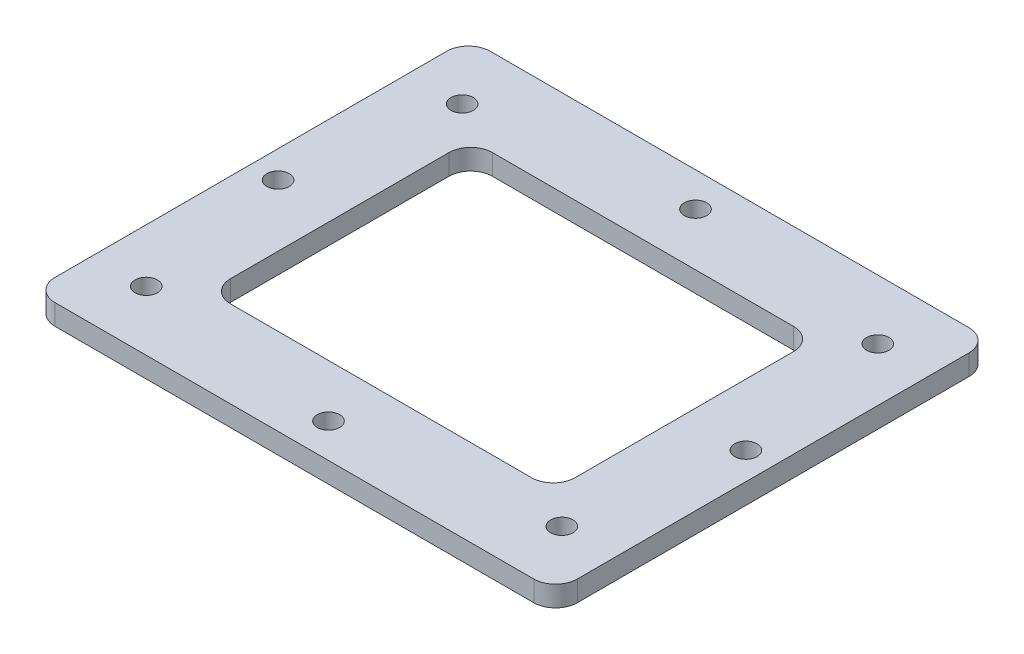
ISO-10303-21;
HEADER;
FILE_DESCRIPTION(('STEP AP214'),'2;1');
FILE_NAME('part.step','',(''),(''),'','','');
FILE_SCHEMA(('AUTOMOTIVE_DESIGN { 1 0 10303 214 1 1 1 1 }'));
ENDSEC;
DATA;
#1=APPLICATION_CONTEXT('core data for automotive mechanical design processes');
#2=APPLICATION_PROTOCOL_DEFINITION('international standard','automotive_design',2000,#1);
#3=PRODUCT_CONTEXT('',#1,'mechanical');
#4=PRODUCT('Part','Part','',(#3));
#5=PRODUCT_RELATED_PRODUCT_CATEGORY('part','',(#4));
#6=PRODUCT_DEFINITION_FORMATION('','',#4);
#7=PRODUCT_DEFINITION_CONTEXT('part definition',#1,'design');
#8=PRODUCT_DEFINITION('design','',#6,#7);
#9=PRODUCT_DEFINITION_SHAPE('','',#8);
#10=(LENGTH_UNIT() NAMED_UNIT(*) SI_UNIT(.MILLI.,.METRE.));
#11=(NAMED_UNIT(*) PLANE_ANGLE_UNIT() SI_UNIT($,.RADIAN.));
#12=(NAMED_UNIT(*) SI_UNIT($,.STERADIAN.) SOLID_ANGLE_UNIT());
#13=UNCERTAINTY_MEASURE_WITH_UNIT(LENGTH_MEASURE(1.E-05),#10,'distance_accuracy_value','');
#14=(GEOMETRIC_REPRESENTATION_CONTEXT(3) GLOBAL_UNCERTAINTY_ASSIGNED_CONTEXT((#13)) GLOBAL_UNIT_ASSIGNED_CONTEXT((#10,
#11,#12)) REPRESENTATION_CONTEXT('',''));
#15=CARTESIAN_POINT('',(0.,0.,0.));
#16=DIRECTION('',(0.,0.,1.));
#17=DIRECTION('',(1.,0.,0.));
#18=AXIS2_PLACEMENT_3D('',#15,#16,#17);
#19=CARTESIAN_POINT('',(0.,1.5,0.));
#20=DIRECTION('',(0.,1.,0.));
#21=DIRECTION('',(0.,0.,1.));
#22=AXIS2_PLACEMENT_3D('',#19,#20,#21);
#23=PLANE('',#22);
#24=CARTESIAN_POINT('',(-34.125,1.5,0.));
#25=DIRECTION('',(0.,1.,0.));
#26=DIRECTION('',(0.,0.,1.));
#27=AXIS2_PLACEMENT_3D('',#24,#25,#26);
#28=CIRCLE('',#27,1.63195);
#29=CARTESIAN_POINT('',(-34.125,1.5,1.63195000000001));
#30=VERTEX_POINT('',#29);
#31=EDGE_CURVE('E335',#30,#30,#28,.T.);
#32=ORIENTED_EDGE('',*,*,#31,.F.);
#33=EDGE_LOOP('',(#32));
#34=FACE_BOUND('',#33,.T.);
#35=CARTESIAN_POINT('',(-30.315,1.5,23.045));
#36=DIRECTION('',(0.,1.,0.));
#37=DIRECTION('',(0.,0.,1.));
#38=AXIS2_PLACEMENT_3D('',#35,#36,#37);
#39=CIRCLE('',#38,1.63195);
#40=CARTESIAN_POINT('',(-30.315,1.5,24.67695));
#41=VERTEX_POINT('',#40);
#42=EDGE_CURVE('E322',#41,#41,#39,.T.);
#43=ORIENTED_EDGE('',*,*,#42,.F.);
#44=EDGE_LOOP('',(#43));
#45=FACE_BOUND('',#44,.T.);
#46=CARTESIAN_POINT('',(0.,1.5,26.77));
#47=DIRECTION('',(0.,1.,0.));
#48=DIRECTION('',(0.,0.,1.));
#49=AXIS2_PLACEMENT_3D('',#46,#47,#48);
#50=CIRCLE('',#49,1.63195);
#51=CARTESIAN_POINT('',(0.,1.5,28.40195));
#52=VERTEX_POINT('',#51);
#53=EDGE_CURVE('E318',#52,#52,#50,.T.);
#54=ORIENTED_EDGE('',*,*,#53,.F.);
#55=EDGE_LOOP('',(#54));
#56=FACE_BOUND('',#55,.T.);
#57=CARTESIAN_POINT('',(30.315,1.5,23.045));
#58=DIRECTION('',(0.,1.,0.));
#59=DIRECTION('',(0.,0.,1.));
#60=AXIS2_PLACEMENT_3D('',#57,#58,#59);
#61=CIRCLE('',#60,1.63195);
#62=CARTESIAN_POINT('',(30.315,1.5,24.67695));
#63=VERTEX_POINT('',#62);
#64=EDGE_CURVE('E314',#63,#63,#61,.T.);
#65=ORIENTED_EDGE('',*,*,#64,.F.);
#66=EDGE_LOOP('',(#65));
#67=FACE_BOUND('',#66,.T.);
#68=CARTESIAN_POINT('',(34.125,1.5,0.));
#69=DIRECTION('',(0.,1.,0.));
#70=DIRECTION('',(0.,0.,1.));
#71=AXIS2_PLACEMENT_3D('',#68,#69,#70);
#72=CIRCLE('',#71,1.63195);
#73=CARTESIAN_POINT('',(34.125,1.5,1.63195000000001));
#74=VERTEX_POINT('',#73);
#75=EDGE_CURVE('E309',#74,#74,#72,.T.);
#76=ORIENTED_EDGE('',*,*,#75,.F.);
#77=EDGE_LOOP('',(#76));
#78=FACE_BOUND('',#77,.T.);
#79=CARTESIAN_POINT('',(30.315,1.5,-23.045));
#80=DIRECTION('',(0.,1.,0.));
#81=DIRECTION('',(0.,0.,1.));
#82=AXIS2_PLACEMENT_3D('',#79,#80,#81);
#83=CIRCLE('',#82,1.63195);
#84=CARTESIAN_POINT('',(30.315,1.5,-21.41305));
#85=VERTEX_POINT('',#84);
#86=EDGE_CURVE('E304',#85,#85,#83,.T.);
#87=ORIENTED_EDGE('',*,*,#86,.F.);
#88=EDGE_LOOP('',(#87));
#89=FACE_BOUND('',#88,.T.);
#90=CARTESIAN_POINT('',(0.,1.5,-26.77));
#91=DIRECTION('',(0.,1.,0.));
#92=DIRECTION('',(0.,0.,1.));
#93=AXIS2_PLACEMENT_3D('',#90,#91,#92);
#94=CIRCLE('',#93,1.63195);
#95=CARTESIAN_POINT('',(0.,1.5,-25.13805));
#96=VERTEX_POINT('',#95);
#97=EDGE_CURVE('E299',#96,#96,#94,.T.);
#98=ORIENTED_EDGE('',*,*,#97,.F.);
#99=EDGE_LOOP('',(#98));
#100=FACE_BOUND('',#99,.T.);
#101=CARTESIAN_POINT('',(-30.315,1.5,-23.045));
#102=DIRECTION('',(0.,1.,0.));
#103=DIRECTION('',(0.,0.,1.));
#104=AXIS2_PLACEMENT_3D('',#101,#102,#103);
#105=CIRCLE('',#104,1.63195);
#106=CARTESIAN_POINT('',(-30.315,1.5,-21.41305));
#107=VERTEX_POINT('',#106);
#108=EDGE_CURVE('E294',#107,#107,#105,.T.);
#109=ORIENTED_EDGE('',*,*,#108,.F.);
#110=EDGE_LOOP('',(#109));
#111=FACE_BOUND('',#110,.T.);
#112=DIRECTION('',(-1.,0.,0.));
#113=VECTOR('',#112,1.);
#114=CARTESIAN_POINT('',(-38.1,1.5,-31.75));
#115=LINE('',#114,#113);
#116=CARTESIAN_POINT('',(34.925,1.5,-31.75));
#117=VERTEX_POINT('',#116);
#118=CARTESIAN_POINT('',(-34.925,1.5,-31.75));
#119=VERTEX_POINT('',#118);
#120=EDGE_CURVE('E380',#117,#119,#115,.T.);
#121=ORIENTED_EDGE('',*,*,#120,.T.);
#122=CARTESIAN_POINT('',(-34.925,1.5,-28.575));
#123=DIRECTION('',(0.,1.,0.));
#124=DIRECTION('',(0.,0.,1.));
#125=AXIS2_PLACEMENT_3D('',#122,#123,#124);
#126=CIRCLE('',#125,3.175);
#127=CARTESIAN_POINT('',(-38.1,1.5,-28.575));
#128=VERTEX_POINT('',#127);
#129=EDGE_CURVE('E256',#119,#128,#126,.T.);
#130=ORIENTED_EDGE('',*,*,#129,.T.);
#131=DIRECTION('',(0.,0.,1.));
#132=VECTOR('',#131,1.);
#133=CARTESIAN_POINT('',(-38.1,1.5,-31.75));
#134=LINE('',#133,#132);
#135=CARTESIAN_POINT('',(-38.1,1.5,28.575));
#136=VERTEX_POINT('',#135);
#137=EDGE_CURVE('E197',#128,#136,#134,.T.);
#138=ORIENTED_EDGE('',*,*,#137,.T.);
#139=CARTESIAN_POINT('',(-34.925,1.5,28.575));
#140=DIRECTION('',(0.,1.,0.));
#141=DIRECTION('',(0.,0.,1.));
#142=AXIS2_PLACEMENT_3D('',#139,#140,#141);
#143=CIRCLE('',#142,3.175);
#144=CARTESIAN_POINT('',(-34.925,1.5,31.75));
#145=VERTEX_POINT('',#144);
#146=EDGE_CURVE('E72',#136,#145,#143,.T.);
#147=ORIENTED_EDGE('',*,*,#146,.T.);
#148=DIRECTION('',(1.,0.,0.));
#149=VECTOR('',#148,1.);
#150=CARTESIAN_POINT('',(-38.1,1.5,31.75));
#151=LINE('',#150,#149);
#152=CARTESIAN_POINT('',(34.925,1.5,31.75));
#153=VERTEX_POINT('',#152);
#154=EDGE_CURVE('E191',#145,#153,#151,.T.);
#155=ORIENTED_EDGE('',*,*,#154,.T.);
#156=CARTESIAN_POINT('',(34.925,1.5,28.575));
#157=DIRECTION('',(0.,1.,0.));
#158=DIRECTION('',(0.,0.,1.));
#159=AXIS2_PLACEMENT_3D('',#156,#157,#158);
#160=CIRCLE('',#159,3.175);
#161=CARTESIAN_POINT('',(38.1,1.5,28.575));
#162=VERTEX_POINT('',#161);
#163=EDGE_CURVE('E250',#153,#162,#160,.T.);
#164=ORIENTED_EDGE('',*,*,#163,.T.);
#165=DIRECTION('',(0.,0.,-1.));
#166=VECTOR('',#165,1.);
#167=CARTESIAN_POINT('',(38.1,1.5,-31.75));
#168=LINE('',#167,#166);
#169=CARTESIAN_POINT('',(38.1,1.5,-28.575));
#170=VERTEX_POINT('',#169);
#171=EDGE_CURVE('E376',#162,#170,#168,.T.);
#172=ORIENTED_EDGE('',*,*,#171,.T.);
#173=CARTESIAN_POINT('',(34.925,1.5,-28.575));
#174=DIRECTION('',(0.,1.,0.));
#175=DIRECTION('',(0.,0.,1.));
#176=AXIS2_PLACEMENT_3D('',#173,#174,#175);
#177=CIRCLE('',#176,3.175);
#178=EDGE_CURVE('E253',#170,#117,#177,.T.);
#179=ORIENTED_EDGE('',*,*,#178,.T.);
#180=EDGE_LOOP('',(#121,#130,#138,#147,#155,#164,#172,#179));
#181=FACE_BOUND('',#180,.T.);
#182=DIRECTION('',(-1.,0.,0.));
#183=VECTOR('',#182,1.);
#184=CARTESIAN_POINT('',(-25.140406267068,1.5,-19.1113528756254));
#185=LINE('',#184,#183);
#186=CARTESIAN_POINT('',(21.965406267068,1.5,-19.1113528756254));
#187=VERTEX_POINT('',#186);
#188=CARTESIAN_POINT('',(-21.965406267068,1.5,-19.1113528756254));
#189=VERTEX_POINT('',#188);
#190=EDGE_CURVE('E357',#187,#189,#185,.T.);
#191=ORIENTED_EDGE('',*,*,#190,.F.);
#192=CARTESIAN_POINT('',(21.965406267068,1.5,-15.9363528756254));
#193=DIRECTION('',(0.,1.,0.));
#194=DIRECTION('',(0.,0.,1.));
#195=AXIS2_PLACEMENT_3D('',#192,#193,#194);
#196=CIRCLE('',#195,3.175);
#197=CARTESIAN_POINT('',(25.140406267068,1.5,-15.9363528756254));
#198=VERTEX_POINT('',#197);
#199=EDGE_CURVE('E175',#187,#198,#196,.F.);
#200=ORIENTED_EDGE('',*,*,#199,.T.);
#201=DIRECTION('',(0.,0.,-1.));
#202=VECTOR('',#201,1.);
#203=CARTESIAN_POINT('',(25.140406267068,1.5,-19.1113528756254));
#204=LINE('',#203,#202);
#205=CARTESIAN_POINT('',(25.140406267068,1.5,15.9363528756254));
#206=VERTEX_POINT('',#205);
#207=EDGE_CURVE('E353',#206,#198,#204,.T.);
#208=ORIENTED_EDGE('',*,*,#207,.F.);
#209=CARTESIAN_POINT('',(21.965406267068,1.5,15.9363528756254));
#210=DIRECTION('',(0.,1.,0.));
#211=DIRECTION('',(0.,0.,1.));
#212=AXIS2_PLACEMENT_3D('',#209,#210,#211);
#213=CIRCLE('',#212,3.175);
#214=CARTESIAN_POINT('',(21.965406267068,1.5,19.1113528756254));
#215=VERTEX_POINT('',#214);
#216=EDGE_CURVE('E281',#206,#215,#213,.F.);
#217=ORIENTED_EDGE('',*,*,#216,.T.);
#218=DIRECTION('',(1.,0.,0.));
#219=VECTOR('',#218,1.);
#220=CARTESIAN_POINT('',(-25.140406267068,1.5,19.1113528756254));
#221=LINE('',#220,#219);
#222=CARTESIAN_POINT('',(-21.965406267068,1.5,19.1113528756254));
#223=VERTEX_POINT('',#222);
#224=EDGE_CURVE('E364',#223,#215,#221,.T.);
#225=ORIENTED_EDGE('',*,*,#224,.F.);
#226=CARTESIAN_POINT('',(-21.965406267068,1.5,15.9363528756254));
#227=DIRECTION('',(0.,1.,0.));
#228=DIRECTION('',(0.,0.,1.));
#229=AXIS2_PLACEMENT_3D('',#226,#227,#228);
#230=CIRCLE('',#229,3.175);
#231=CARTESIAN_POINT('',(-25.140406267068,1.5,15.9363528756254));
#232=VERTEX_POINT('',#231);
#233=EDGE_CURVE('E275',#223,#232,#230,.F.);
#234=ORIENTED_EDGE('',*,*,#233,.T.);
#235=DIRECTION('',(0.,0.,1.));
#236=VECTOR('',#235,1.);
#237=CARTESIAN_POINT('',(-25.140406267068,1.5,-19.1113528756254));
#238=LINE('',#237,#236);
#239=CARTESIAN_POINT('',(-25.140406267068,1.5,-15.9363528756254));
#240=VERTEX_POINT('',#239);
#241=EDGE_CURVE('E361',#240,#232,#238,.T.);
#242=ORIENTED_EDGE('',*,*,#241,.F.);
#243=CARTESIAN_POINT('',(-21.965406267068,1.5,-15.9363528756254));
#244=DIRECTION('',(0.,1.,0.));
#245=DIRECTION('',(0.,0.,1.));
#246=AXIS2_PLACEMENT_3D('',#243,#244,#245);
#247=CIRCLE('',#246,3.175);
#248=EDGE_CURVE('E11',#240,#189,#247,.F.);
#249=ORIENTED_EDGE('',*,*,#248,.T.);
#250=EDGE_LOOP('',(#191,#200,#208,#217,#225,#234,#242,#249));
#251=FACE_BOUND('',#250,.T.);
#252=ADVANCED_FACE('F47',(#34,#45,#56,#67,#78,#89,#100,#111,#181,#251),#23,.T.);
#253=CARTESIAN_POINT('',(0.,-1.5,0.));
#254=DIRECTION('',(0.,1.,0.));
#255=DIRECTION('',(0.,0.,1.));
#256=AXIS2_PLACEMENT_3D('',#253,#254,#255);
#257=PLANE('',#256);
#258=CARTESIAN_POINT('',(-34.125,-1.5,0.));
#259=DIRECTION('',(0.,1.,0.));
#260=DIRECTION('',(0.,0.,1.));
#261=AXIS2_PLACEMENT_3D('',#258,#259,#260);
#262=CIRCLE('',#261,1.63195);
#263=CARTESIAN_POINT('',(-34.125,-1.5,1.63195000000001));
#264=VERTEX_POINT('',#263);
#265=EDGE_CURVE('E51',#264,#264,#262,.T.);
#266=ORIENTED_EDGE('',*,*,#265,.T.);
#267=EDGE_LOOP('',(#266));
#268=FACE_BOUND('',#267,.T.);
#269=CARTESIAN_POINT('',(-30.315,-1.5,23.045));
#270=DIRECTION('',(0.,1.,0.));
#271=DIRECTION('',(0.,0.,1.));
#272=AXIS2_PLACEMENT_3D('',#269,#270,#271);
#273=CIRCLE('',#272,1.63195);
#274=CARTESIAN_POINT('',(-30.315,-1.5,24.67695));
#275=VERTEX_POINT('',#274);
#276=EDGE_CURVE('E319',#275,#275,#273,.T.);
#277=ORIENTED_EDGE('',*,*,#276,.T.);
#278=EDGE_LOOP('',(#277));
#279=FACE_BOUND('',#278,.T.);
#280=CARTESIAN_POINT('',(0.,-1.5,26.77));
#281=DIRECTION('',(0.,1.,0.));
#282=DIRECTION('',(0.,0.,1.));
#283=AXIS2_PLACEMENT_3D('',#280,#281,#282);
#284=CIRCLE('',#283,1.63195);
#285=CARTESIAN_POINT('',(0.,-1.5,28.40195));
#286=VERTEX_POINT('',#285);
#287=EDGE_CURVE('E315',#286,#286,#284,.T.);
#288=ORIENTED_EDGE('',*,*,#287,.T.);
#289=EDGE_LOOP('',(#288));
#290=FACE_BOUND('',#289,.T.);
#291=CARTESIAN_POINT('',(30.315,-1.5,23.045));
#292=DIRECTION('',(0.,1.,0.));
#293=DIRECTION('',(0.,0.,1.));
#294=AXIS2_PLACEMENT_3D('',#291,#292,#293);
#295=CIRCLE('',#294,1.63195);
#296=CARTESIAN_POINT('',(30.315,-1.5,24.67695));
#297=VERTEX_POINT('',#296);
#298=EDGE_CURVE('E310',#297,#297,#295,.T.);
#299=ORIENTED_EDGE('',*,*,#298,.T.);
#300=EDGE_LOOP('',(#299));
#301=FACE_BOUND('',#300,.T.);
#302=CARTESIAN_POINT('',(34.125,-1.5,0.));
#303=DIRECTION('',(0.,1.,0.));
#304=DIRECTION('',(0.,0.,1.));
#305=AXIS2_PLACEMENT_3D('',#302,#303,#304);
#306=CIRCLE('',#305,1.63195);
#307=CARTESIAN_POINT('',(34.125,-1.5,1.63195000000001));
#308=VERTEX_POINT('',#307);
#309=EDGE_CURVE('E305',#308,#308,#306,.T.);
#310=ORIENTED_EDGE('',*,*,#309,.T.);
#311=EDGE_LOOP('',(#310));
#312=FACE_BOUND('',#311,.T.);
#313=CARTESIAN_POINT('',(30.315,-1.5,-23.045));
#314=DIRECTION('',(0.,1.,0.));
#315=DIRECTION('',(0.,0.,1.));
#316=AXIS2_PLACEMENT_3D('',#313,#314,#315);
#317=CIRCLE('',#316,1.63195);
#318=CARTESIAN_POINT('',(30.315,-1.5,-21.41305));
#319=VERTEX_POINT('',#318);
#320=EDGE_CURVE('E300',#319,#319,#317,.T.);
#321=ORIENTED_EDGE('',*,*,#320,.T.);
#322=EDGE_LOOP('',(#321));
#323=FACE_BOUND('',#322,.T.);
#324=CARTESIAN_POINT('',(0.,-1.5,-26.77));
#325=DIRECTION('',(0.,1.,0.));
#326=DIRECTION('',(0.,0.,1.));
#327=AXIS2_PLACEMENT_3D('',#324,#325,#326);
#328=CIRCLE('',#327,1.63195);
#329=CARTESIAN_POINT('',(0.,-1.5,-25.13805));
#330=VERTEX_POINT('',#329);
#331=EDGE_CURVE('E295',#330,#330,#328,.T.);
#332=ORIENTED_EDGE('',*,*,#331,.T.);
#333=EDGE_LOOP('',(#332));
#334=FACE_BOUND('',#333,.T.);
#335=CARTESIAN_POINT('',(-30.315,-1.5,-23.045));
#336=DIRECTION('',(0.,1.,0.));
#337=DIRECTION('',(0.,0.,1.));
#338=AXIS2_PLACEMENT_3D('',#335,#336,#337);
#339=CIRCLE('',#338,1.63195);
#340=CARTESIAN_POINT('',(-30.315,-1.5,-21.41305));
#341=VERTEX_POINT('',#340);
#342=EDGE_CURVE('E289',#341,#341,#339,.T.);
#343=ORIENTED_EDGE('',*,*,#342,.T.);
#344=EDGE_LOOP('',(#343));
#345=FACE_BOUND('',#344,.T.);
#346=DIRECTION('',(0.,0.,1.));
#347=VECTOR('',#346,1.);
#348=CARTESIAN_POINT('',(-38.1,-1.5,-31.75));
#349=LINE('',#348,#347);
#350=CARTESIAN_POINT('',(-38.1,-1.5,-28.575));
#351=VERTEX_POINT('',#350);
#352=CARTESIAN_POINT('',(-38.1,-1.5,28.575));
#353=VERTEX_POINT('',#352);
#354=EDGE_CURVE('E392',#351,#353,#349,.T.);
#355=ORIENTED_EDGE('',*,*,#354,.F.);
#356=CARTESIAN_POINT('',(-34.925,-1.5,-28.575));
#357=DIRECTION('',(0.,1.,0.));
#358=DIRECTION('',(0.,0.,1.));
#359=AXIS2_PLACEMENT_3D('',#356,#357,#358);
#360=CIRCLE('',#359,3.175);
#361=CARTESIAN_POINT('',(-34.925,-1.5,-31.75));
#362=VERTEX_POINT('',#361);
#363=EDGE_CURVE('E238',#351,#362,#360,.F.);
#364=ORIENTED_EDGE('',*,*,#363,.T.);
#365=DIRECTION('',(-1.,0.,0.));
#366=VECTOR('',#365,1.);
#367=CARTESIAN_POINT('',(-38.1,-1.5,-31.75));
#368=LINE('',#367,#366);
#369=CARTESIAN_POINT('',(34.925,-1.5,-31.75));
#370=VERTEX_POINT('',#369);
#371=EDGE_CURVE('E389',#370,#362,#368,.T.);
#372=ORIENTED_EDGE('',*,*,#371,.F.);
#373=CARTESIAN_POINT('',(34.925,-1.5,-28.575));
#374=DIRECTION('',(0.,1.,0.));
#375=DIRECTION('',(0.,0.,1.));
#376=AXIS2_PLACEMENT_3D('',#373,#374,#375);
#377=CIRCLE('',#376,3.175);
#378=CARTESIAN_POINT('',(38.1,-1.5,-28.575));
#379=VERTEX_POINT('',#378);
#380=EDGE_CURVE('E235',#370,#379,#377,.F.);
#381=ORIENTED_EDGE('',*,*,#380,.T.);
#382=DIRECTION('',(0.,0.,-1.));
#383=VECTOR('',#382,1.);
#384=CARTESIAN_POINT('',(38.1,-1.5,-31.75));
#385=LINE('',#384,#383);
#386=CARTESIAN_POINT('',(38.1,-1.5,28.575));
#387=VERTEX_POINT('',#386);
#388=EDGE_CURVE('E368',#387,#379,#385,.T.);
#389=ORIENTED_EDGE('',*,*,#388,.F.);
#390=CARTESIAN_POINT('',(34.925,-1.5,28.575));
#391=DIRECTION('',(0.,1.,0.));
#392=DIRECTION('',(0.,0.,1.));
#393=AXIS2_PLACEMENT_3D('',#390,#391,#392);
#394=CIRCLE('',#393,3.175);
#395=CARTESIAN_POINT('',(34.925,-1.5,31.75));
#396=VERTEX_POINT('',#395);
#397=EDGE_CURVE('E232',#387,#396,#394,.F.);
#398=ORIENTED_EDGE('',*,*,#397,.T.);
#399=DIRECTION('',(1.,0.,0.));
#400=VECTOR('',#399,1.);
#401=CARTESIAN_POINT('',(-38.1,-1.5,31.75));
#402=LINE('',#401,#400);
#403=CARTESIAN_POINT('',(-34.925,-1.5,31.75));
#404=VERTEX_POINT('',#403);
#405=EDGE_CURVE('E200',#404,#396,#402,.T.);
#406=ORIENTED_EDGE('',*,*,#405,.F.);
#407=CARTESIAN_POINT('',(-34.925,-1.5,28.575));
#408=DIRECTION('',(0.,1.,0.));
#409=DIRECTION('',(0.,0.,1.));
#410=AXIS2_PLACEMENT_3D('',#407,#408,#409);
#411=CIRCLE('',#410,3.175);
#412=EDGE_CURVE('E229',#404,#353,#411,.F.);
#413=ORIENTED_EDGE('',*,*,#412,.T.);
#414=EDGE_LOOP('',(#355,#364,#372,#381,#389,#398,#406,#413));
#415=FACE_BOUND('',#414,.T.);
#416=DIRECTION('',(1.,0.,0.));
#417=VECTOR('',#416,1.);
#418=CARTESIAN_POINT('',(-25.140406267068,-1.5,19.1113528756254));
#419=LINE('',#418,#417);
#420=CARTESIAN_POINT('',(-21.965406267068,-1.5,19.1113528756254));
#421=VERTEX_POINT('',#420);
#422=CARTESIAN_POINT('',(21.965406267068,-1.5,19.1113528756254));
#423=VERTEX_POINT('',#422);
#424=EDGE_CURVE('E186',#421,#423,#419,.T.);
#425=ORIENTED_EDGE('',*,*,#424,.T.);
#426=CARTESIAN_POINT('',(21.965406267068,-1.5,15.9363528756254));
#427=DIRECTION('',(0.,1.,0.));
#428=DIRECTION('',(0.,0.,1.));
#429=AXIS2_PLACEMENT_3D('',#426,#427,#428);
#430=CIRCLE('',#429,3.175);
#431=CARTESIAN_POINT('',(25.140406267068,-1.5,15.9363528756254));
#432=VERTEX_POINT('',#431);
#433=EDGE_CURVE('E278',#423,#432,#430,.T.);
#434=ORIENTED_EDGE('',*,*,#433,.T.);
#435=DIRECTION('',(0.,0.,-1.));
#436=VECTOR('',#435,1.);
#437=CARTESIAN_POINT('',(25.140406267068,-1.5,-19.1113528756254));
#438=LINE('',#437,#436);
#439=CARTESIAN_POINT('',(25.140406267068,-1.5,-15.9363528756254));
#440=VERTEX_POINT('',#439);
#441=EDGE_CURVE('E293',#432,#440,#438,.T.);
#442=ORIENTED_EDGE('',*,*,#441,.T.);
#443=CARTESIAN_POINT('',(21.965406267068,-1.5,-15.9363528756254));
#444=DIRECTION('',(0.,1.,0.));
#445=DIRECTION('',(0.,0.,1.));
#446=AXIS2_PLACEMENT_3D('',#443,#444,#445);
#447=CIRCLE('',#446,3.175);
#448=CARTESIAN_POINT('',(21.965406267068,-1.5,-19.1113528756254));
#449=VERTEX_POINT('',#448);
#450=EDGE_CURVE('E284',#440,#449,#447,.T.);
#451=ORIENTED_EDGE('',*,*,#450,.T.);
#452=DIRECTION('',(-1.,0.,0.));
#453=VECTOR('',#452,1.);
#454=CARTESIAN_POINT('',(-25.140406267068,-1.5,-19.1113528756254));
#455=LINE('',#454,#453);
#456=CARTESIAN_POINT('',(-21.965406267068,-1.5,-19.1113528756254));
#457=VERTEX_POINT('',#456);
#458=EDGE_CURVE('E169',#449,#457,#455,.T.);
#459=ORIENTED_EDGE('',*,*,#458,.T.);
#460=CARTESIAN_POINT('',(-21.965406267068,-1.5,-15.9363528756254));
#461=DIRECTION('',(0.,1.,0.));
#462=DIRECTION('',(0.,0.,1.));
#463=AXIS2_PLACEMENT_3D('',#460,#461,#462);
#464=CIRCLE('',#463,3.175);
#465=CARTESIAN_POINT('',(-25.140406267068,-1.5,-15.9363528756254));
#466=VERTEX_POINT('',#465);
#467=EDGE_CURVE('E57',#457,#466,#464,.T.);
#468=ORIENTED_EDGE('',*,*,#467,.T.);
#469=DIRECTION('',(0.,0.,1.));
#470=VECTOR('',#469,1.);
#471=CARTESIAN_POINT('',(-25.140406267068,-1.5,-19.1113528756254));
#472=LINE('',#471,#470);
#473=CARTESIAN_POINT('',(-25.140406267068,-1.5,15.9363528756254));
#474=VERTEX_POINT('',#473);
#475=EDGE_CURVE('E167',#466,#474,#472,.T.);
#476=ORIENTED_EDGE('',*,*,#475,.T.);
#477=CARTESIAN_POINT('',(-21.965406267068,-1.5,15.9363528756254));
#478=DIRECTION('',(0.,1.,0.));
#479=DIRECTION('',(0.,0.,1.));
#480=AXIS2_PLACEMENT_3D('',#477,#478,#479);
#481=CIRCLE('',#480,3.175);
#482=EDGE_CURVE('E272',#474,#421,#481,.T.);
#483=ORIENTED_EDGE('',*,*,#482,.T.);
#484=EDGE_LOOP('',(#425,#434,#442,#451,#459,#468,#476,#483));
#485=FACE_BOUND('',#484,.T.);
#486=ADVANCED_FACE('F166',(#268,#279,#290,#301,#312,#323,#334,#345,#415,#485),#257,.F.);
#487=CARTESIAN_POINT('',(38.1,1.5,-31.75));
#488=DIRECTION('',(-1.,0.,0.));
#489=DIRECTION('',(0.,0.,1.));
#490=AXIS2_PLACEMENT_3D('',#487,#488,#489);
#491=PLANE('',#490);
#492=ORIENTED_EDGE('',*,*,#388,.T.);
#493=DIRECTION('',(0.,-1.,0.));
#494=VECTOR('',#493,1.);
#495=CARTESIAN_POINT('',(38.1,1.5,-28.575));
#496=LINE('',#495,#494);
#497=EDGE_CURVE('E263',#379,#170,#496,.F.);
#498=ORIENTED_EDGE('',*,*,#497,.T.);
#499=ORIENTED_EDGE('',*,*,#171,.F.);
#500=DIRECTION('',(0.,-1.,0.));
#501=VECTOR('',#500,1.);
#502=CARTESIAN_POINT('',(38.1,1.5,28.575));
#503=LINE('',#502,#501);
#504=EDGE_CURVE('E259',#162,#387,#503,.T.);
#505=ORIENTED_EDGE('',*,*,#504,.T.);
#506=EDGE_LOOP('',(#492,#498,#499,#505));
#507=FACE_BOUND('',#506,.T.);
#508=ADVANCED_FACE('F411',(#507),#491,.F.);
#509=CARTESIAN_POINT('',(-38.1,1.5,-31.75));
#510=DIRECTION('',(0.,0.,1.));
#511=DIRECTION('',(1.,0.,0.));
#512=AXIS2_PLACEMENT_3D('',#509,#510,#511);
#513=PLANE('',#512);
#514=ORIENTED_EDGE('',*,*,#371,.T.);
#515=DIRECTION('',(0.,-1.,0.));
#516=VECTOR('',#515,1.);
#517=CARTESIAN_POINT('',(-34.925,1.5,-31.75));
#518=LINE('',#517,#516);
#519=EDGE_CURVE('E245',#362,#119,#518,.F.);
#520=ORIENTED_EDGE('',*,*,#519,.T.);
#521=ORIENTED_EDGE('',*,*,#120,.F.);
#522=DIRECTION('',(0.,-1.,0.));
#523=VECTOR('',#522,1.);
#524=CARTESIAN_POINT('',(34.925,1.5,-31.75));
#525=LINE('',#524,#523);
#526=EDGE_CURVE('E241',#117,#370,#525,.T.);
#527=ORIENTED_EDGE('',*,*,#526,.T.);
#528=EDGE_LOOP('',(#514,#520,#521,#527));
#529=FACE_BOUND('',#528,.T.);
#530=ADVANCED_FACE('F420',(#529),#513,.F.);
#531=CARTESIAN_POINT('',(-38.1,1.5,-31.75));
#532=DIRECTION('',(1.,0.,0.));
#533=DIRECTION('',(0.,0.,-1.));
#534=AXIS2_PLACEMENT_3D('',#531,#532,#533);
#535=PLANE('',#534);
#536=ORIENTED_EDGE('',*,*,#137,.F.);
#537=DIRECTION('',(0.,-1.,0.));
#538=VECTOR('',#537,1.);
#539=CARTESIAN_POINT('',(-38.1,1.5,-28.575));
#540=LINE('',#539,#538);
#541=EDGE_CURVE('E225',#128,#351,#540,.T.);
#542=ORIENTED_EDGE('',*,*,#541,.T.);
#543=ORIENTED_EDGE('',*,*,#354,.T.);
#544=DIRECTION('',(0.,-1.,0.));
#545=VECTOR('',#544,1.);
#546=CARTESIAN_POINT('',(-38.1,1.5,28.575));
#547=LINE('',#546,#545);
#548=EDGE_CURVE('E222',#353,#136,#547,.F.);
#549=ORIENTED_EDGE('',*,*,#548,.T.);
#550=EDGE_LOOP('',(#536,#542,#543,#549));
#551=FACE_BOUND('',#550,.T.);
#552=ADVANCED_FACE('F427',(#551),#535,.F.);
#553=CARTESIAN_POINT('',(-38.1,1.5,31.75));
#554=DIRECTION('',(0.,0.,-1.));
#555=DIRECTION('',(-1.,0.,0.));
#556=AXIS2_PLACEMENT_3D('',#553,#554,#555);
#557=PLANE('',#556);
#558=ORIENTED_EDGE('',*,*,#405,.T.);
#559=DIRECTION('',(0.,-1.,0.));
#560=VECTOR('',#559,1.);
#561=CARTESIAN_POINT('',(34.925,1.5,31.75));
#562=LINE('',#561,#560);
#563=EDGE_CURVE('E65',#396,#153,#562,.F.);
#564=ORIENTED_EDGE('',*,*,#563,.T.);
#565=ORIENTED_EDGE('',*,*,#154,.F.);
#566=DIRECTION('',(0.,-1.,0.));
#567=VECTOR('',#566,1.);
#568=CARTESIAN_POINT('',(-34.925,1.5,31.75));
#569=LINE('',#568,#567);
#570=EDGE_CURVE('E266',#145,#404,#569,.T.);
#571=ORIENTED_EDGE('',*,*,#570,.T.);
#572=EDGE_LOOP('',(#558,#564,#565,#571));
#573=FACE_BOUND('',#572,.T.);
#574=ADVANCED_FACE('F400',(#573),#557,.F.);
#575=CARTESIAN_POINT('',(25.140406267068,1.5,-19.1113528756254));
#576=DIRECTION('',(-1.,0.,0.));
#577=DIRECTION('',(0.,0.,1.));
#578=AXIS2_PLACEMENT_3D('',#575,#576,#577);
#579=PLANE('',#578);
#580=ORIENTED_EDGE('',*,*,#441,.F.);
#581=DIRECTION('',(0.,-1.,0.));
#582=VECTOR('',#581,1.);
#583=CARTESIAN_POINT('',(25.140406267068,1.5,15.9363528756254));
#584=LINE('',#583,#582);
#585=EDGE_CURVE('E213',#432,#206,#584,.F.);
#586=ORIENTED_EDGE('',*,*,#585,.T.);
#587=ORIENTED_EDGE('',*,*,#207,.T.);
#588=DIRECTION('',(0.,-1.,0.));
#589=VECTOR('',#588,1.);
#590=CARTESIAN_POINT('',(25.140406267068,-1.5,-15.9363528756254));
#591=LINE('',#590,#589);
#592=EDGE_CURVE('E209',#198,#440,#591,.T.);
#593=ORIENTED_EDGE('',*,*,#592,.T.);
#594=EDGE_LOOP('',(#580,#586,#587,#593));
#595=FACE_BOUND('',#594,.T.);
#596=ADVANCED_FACE('F444',(#595),#579,.T.);
#597=CARTESIAN_POINT('',(-25.140406267068,1.5,-19.1113528756254));
#598=DIRECTION('',(0.,0.,1.));
#599=DIRECTION('',(1.,0.,0.));
#600=AXIS2_PLACEMENT_3D('',#597,#598,#599);
#601=PLANE('',#600);
#602=ORIENTED_EDGE('',*,*,#458,.F.);
#603=DIRECTION('',(0.,-1.,0.));
#604=VECTOR('',#603,1.);
#605=CARTESIAN_POINT('',(21.965406267068,1.5,-19.1113528756254));
#606=LINE('',#605,#604);
#607=EDGE_CURVE('E219',#449,#187,#606,.F.);
#608=ORIENTED_EDGE('',*,*,#607,.T.);
#609=ORIENTED_EDGE('',*,*,#190,.T.);
#610=DIRECTION('',(0.,-1.,0.));
#611=VECTOR('',#610,1.);
#612=CARTESIAN_POINT('',(-21.965406267068,-1.5,-19.1113528756254));
#613=LINE('',#612,#611);
#614=EDGE_CURVE('E216',#189,#457,#613,.T.);
#615=ORIENTED_EDGE('',*,*,#614,.T.);
#616=EDGE_LOOP('',(#602,#608,#609,#615));
#617=FACE_BOUND('',#616,.T.);
#618=ADVANCED_FACE('F493',(#617),#601,.T.);
#619=CARTESIAN_POINT('',(-25.140406267068,1.5,-19.1113528756254));
#620=DIRECTION('',(1.,0.,0.));
#621=DIRECTION('',(0.,0.,-1.));
#622=AXIS2_PLACEMENT_3D('',#619,#620,#621);
#623=PLANE('',#622);
#624=ORIENTED_EDGE('',*,*,#241,.T.);
#625=DIRECTION('',(0.,-1.,0.));
#626=VECTOR('',#625,1.);
#627=CARTESIAN_POINT('',(-25.140406267068,-1.5,15.9363528756254));
#628=LINE('',#627,#626);
#629=EDGE_CURVE('E184',#232,#474,#628,.T.);
#630=ORIENTED_EDGE('',*,*,#629,.T.);
#631=ORIENTED_EDGE('',*,*,#475,.F.);
#632=DIRECTION('',(0.,-1.,0.));
#633=VECTOR('',#632,1.);
#634=CARTESIAN_POINT('',(-25.140406267068,1.5,-15.9363528756254));
#635=LINE('',#634,#633);
#636=EDGE_CURVE('E181',#466,#240,#635,.F.);
#637=ORIENTED_EDGE('',*,*,#636,.T.);
#638=EDGE_LOOP('',(#624,#630,#631,#637));
#639=FACE_BOUND('',#638,.T.);
#640=ADVANCED_FACE('F180',(#639),#623,.T.);
#641=CARTESIAN_POINT('',(-25.140406267068,1.5,19.1113528756254));
#642=DIRECTION('',(0.,0.,-1.));
#643=DIRECTION('',(-1.,0.,0.));
#644=AXIS2_PLACEMENT_3D('',#641,#642,#643);
#645=PLANE('',#644);
#646=ORIENTED_EDGE('',*,*,#424,.F.);
#647=DIRECTION('',(0.,-1.,0.));
#648=VECTOR('',#647,1.);
#649=CARTESIAN_POINT('',(-21.965406267068,1.5,19.1113528756254));
#650=LINE('',#649,#648);
#651=EDGE_CURVE('E206',#421,#223,#650,.F.);
#652=ORIENTED_EDGE('',*,*,#651,.T.);
#653=ORIENTED_EDGE('',*,*,#224,.T.);
#654=DIRECTION('',(0.,-1.,0.));
#655=VECTOR('',#654,1.);
#656=CARTESIAN_POINT('',(21.965406267068,-1.5,19.1113528756254));
#657=LINE('',#656,#655);
#658=EDGE_CURVE('E195',#215,#423,#657,.T.);
#659=ORIENTED_EDGE('',*,*,#658,.T.);
#660=EDGE_LOOP('',(#646,#652,#653,#659));
#661=FACE_BOUND('',#660,.T.);
#662=ADVANCED_FACE('F453',(#661),#645,.T.);
#663=CARTESIAN_POINT('',(-21.965406267068,1.5,15.9363528756254));
#664=DIRECTION('',(0.,1.,0.));
#665=DIRECTION('',(0.,0.,1.));
#666=AXIS2_PLACEMENT_3D('',#663,#664,#665);
#667=CYLINDRICAL_SURFACE('',#666,3.175);
#668=ORIENTED_EDGE('',*,*,#233,.F.);
#669=ORIENTED_EDGE('',*,*,#651,.F.);
#670=ORIENTED_EDGE('',*,*,#482,.F.);
#671=ORIENTED_EDGE('',*,*,#629,.F.);
#672=EDGE_LOOP('',(#668,#669,#670,#671));
#673=FACE_BOUND('',#672,.T.);
#674=ADVANCED_FACE('F449',(#673),#667,.F.);
#675=CARTESIAN_POINT('',(21.965406267068,1.5,15.9363528756254));
#676=DIRECTION('',(0.,1.,0.));
#677=DIRECTION('',(0.,0.,1.));
#678=AXIS2_PLACEMENT_3D('',#675,#676,#677);
#679=CYLINDRICAL_SURFACE('',#678,3.175);
#680=ORIENTED_EDGE('',*,*,#216,.F.);
#681=ORIENTED_EDGE('',*,*,#585,.F.);
#682=ORIENTED_EDGE('',*,*,#433,.F.);
#683=ORIENTED_EDGE('',*,*,#658,.F.);
#684=EDGE_LOOP('',(#680,#681,#682,#683));
#685=FACE_BOUND('',#684,.T.);
#686=ADVANCED_FACE('F452',(#685),#679,.F.);
#687=CARTESIAN_POINT('',(21.965406267068,1.5,-15.9363528756254));
#688=DIRECTION('',(0.,1.,0.));
#689=DIRECTION('',(0.,0.,1.));
#690=AXIS2_PLACEMENT_3D('',#687,#688,#689);
#691=CYLINDRICAL_SURFACE('',#690,3.175);
#692=ORIENTED_EDGE('',*,*,#199,.F.);
#693=ORIENTED_EDGE('',*,*,#607,.F.);
#694=ORIENTED_EDGE('',*,*,#450,.F.);
#695=ORIENTED_EDGE('',*,*,#592,.F.);
#696=EDGE_LOOP('',(#692,#693,#694,#695));
#697=FACE_BOUND('',#696,.T.);
#698=ADVANCED_FACE('F457',(#697),#691,.F.);
#699=CARTESIAN_POINT('',(-21.965406267068,1.5,-15.9363528756254));
#700=DIRECTION('',(0.,1.,0.));
#701=DIRECTION('',(0.,0.,1.));
#702=AXIS2_PLACEMENT_3D('',#699,#700,#701);
#703=CYLINDRICAL_SURFACE('',#702,3.175);
#704=ORIENTED_EDGE('',*,*,#248,.F.);
#705=ORIENTED_EDGE('',*,*,#636,.F.);
#706=ORIENTED_EDGE('',*,*,#467,.F.);
#707=ORIENTED_EDGE('',*,*,#614,.F.);
#708=EDGE_LOOP('',(#704,#705,#706,#707));
#709=FACE_BOUND('',#708,.T.);
#710=ADVANCED_FACE('F189',(#709),#703,.F.);
#711=CARTESIAN_POINT('',(-34.925,1.5,-28.575));
#712=DIRECTION('',(0.,-1.,0.));
#713=DIRECTION('',(0.,0.,-1.));
#714=AXIS2_PLACEMENT_3D('',#711,#712,#713);
#715=CYLINDRICAL_SURFACE('',#714,3.175);
#716=ORIENTED_EDGE('',*,*,#129,.F.);
#717=ORIENTED_EDGE('',*,*,#519,.F.);
#718=ORIENTED_EDGE('',*,*,#363,.F.);
#719=ORIENTED_EDGE('',*,*,#541,.F.);
#720=EDGE_LOOP('',(#716,#717,#718,#719));
#721=FACE_BOUND('',#720,.T.);
#722=ADVANCED_FACE('F424',(#721),#715,.T.);
#723=CARTESIAN_POINT('',(34.925,1.5,-28.575));
#724=DIRECTION('',(0.,-1.,0.));
#725=DIRECTION('',(0.,0.,-1.));
#726=AXIS2_PLACEMENT_3D('',#723,#724,#725);
#727=CYLINDRICAL_SURFACE('',#726,3.175);
#728=ORIENTED_EDGE('',*,*,#178,.F.);
#729=ORIENTED_EDGE('',*,*,#497,.F.);
#730=ORIENTED_EDGE('',*,*,#380,.F.);
#731=ORIENTED_EDGE('',*,*,#526,.F.);
#732=EDGE_LOOP('',(#728,#729,#730,#731));
#733=FACE_BOUND('',#732,.T.);
#734=ADVANCED_FACE('F415',(#733),#727,.T.);
#735=CARTESIAN_POINT('',(34.925,1.5,28.575));
#736=DIRECTION('',(0.,-1.,0.));
#737=DIRECTION('',(0.,0.,-1.));
#738=AXIS2_PLACEMENT_3D('',#735,#736,#737);
#739=CYLINDRICAL_SURFACE('',#738,3.175);
#740=ORIENTED_EDGE('',*,*,#163,.F.);
#741=ORIENTED_EDGE('',*,*,#563,.F.);
#742=ORIENTED_EDGE('',*,*,#397,.F.);
#743=ORIENTED_EDGE('',*,*,#504,.F.);
#744=EDGE_LOOP('',(#740,#741,#742,#743));
#745=FACE_BOUND('',#744,.T.);
#746=ADVANCED_FACE('F405',(#745),#739,.T.);
#747=CARTESIAN_POINT('',(-34.925,1.5,28.575));
#748=DIRECTION('',(0.,-1.,0.));
#749=DIRECTION('',(0.,0.,-1.));
#750=AXIS2_PLACEMENT_3D('',#747,#748,#749);
#751=CYLINDRICAL_SURFACE('',#750,3.175);
#752=ORIENTED_EDGE('',*,*,#146,.F.);
#753=ORIENTED_EDGE('',*,*,#548,.F.);
#754=ORIENTED_EDGE('',*,*,#412,.F.);
#755=ORIENTED_EDGE('',*,*,#570,.F.);
#756=EDGE_LOOP('',(#752,#753,#754,#755));
#757=FACE_BOUND('',#756,.T.);
#758=ADVANCED_FACE('F49',(#757),#751,.T.);
#759=CARTESIAN_POINT('',(-30.315,1.5,-23.045));
#760=DIRECTION('',(0.,1.,0.));
#761=DIRECTION('',(0.,0.,1.));
#762=AXIS2_PLACEMENT_3D('',#759,#760,#761);
#763=CYLINDRICAL_SURFACE('',#762,1.63195);
#764=ORIENTED_EDGE('',*,*,#108,.T.);
#765=EDGE_LOOP('',(#764));
#766=FACE_BOUND('',#765,.T.);
#767=ORIENTED_EDGE('',*,*,#342,.F.);
#768=EDGE_LOOP('',(#767));
#769=FACE_BOUND('',#768,.T.);
#770=ADVANCED_FACE('F471',(#766,#769),#763,.F.);
#771=CARTESIAN_POINT('',(0.,1.5,-26.77));
#772=DIRECTION('',(0.,1.,0.));
#773=DIRECTION('',(0.,0.,1.));
#774=AXIS2_PLACEMENT_3D('',#771,#772,#773);
#775=CYLINDRICAL_SURFACE('',#774,1.63195);
#776=ORIENTED_EDGE('',*,*,#97,.T.);
#777=EDGE_LOOP('',(#776));
#778=FACE_BOUND('',#777,.T.);
#779=ORIENTED_EDGE('',*,*,#331,.F.);
#780=EDGE_LOOP('',(#779));
#781=FACE_BOUND('',#780,.T.);
#782=ADVANCED_FACE('F476',(#778,#781),#775,.F.);
#783=CARTESIAN_POINT('',(30.315,1.5,-23.045));
#784=DIRECTION('',(0.,1.,0.));
#785=DIRECTION('',(0.,0.,1.));
#786=AXIS2_PLACEMENT_3D('',#783,#784,#785);
#787=CYLINDRICAL_SURFACE('',#786,1.63195);
#788=ORIENTED_EDGE('',*,*,#86,.T.);
#789=EDGE_LOOP('',(#788));
#790=FACE_BOUND('',#789,.T.);
#791=ORIENTED_EDGE('',*,*,#320,.F.);
#792=EDGE_LOOP('',(#791));
#793=FACE_BOUND('',#792,.T.);
#794=ADVANCED_FACE('F482',(#790,#793),#787,.F.);
#795=CARTESIAN_POINT('',(34.125,1.5,0.));
#796=DIRECTION('',(0.,1.,0.));
#797=DIRECTION('',(0.,0.,1.));
#798=AXIS2_PLACEMENT_3D('',#795,#796,#797);
#799=CYLINDRICAL_SURFACE('',#798,1.63195);
#800=ORIENTED_EDGE('',*,*,#75,.T.);
#801=EDGE_LOOP('',(#800));
#802=FACE_BOUND('',#801,.T.);
#803=ORIENTED_EDGE('',*,*,#309,.F.);
#804=EDGE_LOOP('',(#803));
#805=FACE_BOUND('',#804,.T.);
#806=ADVANCED_FACE('F588',(#802,#805),#799,.F.);
#807=CARTESIAN_POINT('',(30.315,1.5,23.045));
#808=DIRECTION('',(0.,1.,0.));
#809=DIRECTION('',(0.,0.,1.));
#810=AXIS2_PLACEMENT_3D('',#807,#808,#809);
#811=CYLINDRICAL_SURFACE('',#810,1.63195);
#812=ORIENTED_EDGE('',*,*,#64,.T.);
#813=EDGE_LOOP('',(#812));
#814=FACE_BOUND('',#813,.T.);
#815=ORIENTED_EDGE('',*,*,#298,.F.);
#816=EDGE_LOOP('',(#815));
#817=FACE_BOUND('',#816,.T.);
#818=ADVANCED_FACE('F597',(#814,#817),#811,.F.);
#819=CARTESIAN_POINT('',(0.,1.5,26.77));
#820=DIRECTION('',(0.,1.,0.));
#821=DIRECTION('',(0.,0.,1.));
#822=AXIS2_PLACEMENT_3D('',#819,#820,#821);
#823=CYLINDRICAL_SURFACE('',#822,1.63195);
#824=ORIENTED_EDGE('',*,*,#53,.T.);
#825=EDGE_LOOP('',(#824));
#826=FACE_BOUND('',#825,.T.);
#827=ORIENTED_EDGE('',*,*,#287,.F.);
#828=EDGE_LOOP('',(#827));
#829=FACE_BOUND('',#828,.T.);
#830=ADVANCED_FACE('F607',(#826,#829),#823,.F.);
#831=CARTESIAN_POINT('',(-30.315,1.5,23.045));
#832=DIRECTION('',(0.,1.,0.));
#833=DIRECTION('',(0.,0.,1.));
#834=AXIS2_PLACEMENT_3D('',#831,#832,#833);
#835=CYLINDRICAL_SURFACE('',#834,1.63195);
#836=ORIENTED_EDGE('',*,*,#42,.T.);
#837=EDGE_LOOP('',(#836));
#838=FACE_BOUND('',#837,.T.);
#839=ORIENTED_EDGE('',*,*,#276,.F.);
#840=EDGE_LOOP('',(#839));
#841=FACE_BOUND('',#840,.T.);
#842=ADVANCED_FACE('F617',(#838,#841),#835,.F.);
#843=CARTESIAN_POINT('',(-34.125,1.5,0.));
#844=DIRECTION('',(0.,1.,0.));
#845=DIRECTION('',(0.,0.,1.));
#846=AXIS2_PLACEMENT_3D('',#843,#844,#845);
#847=CYLINDRICAL_SURFACE('',#846,1.63195);
#848=ORIENTED_EDGE('',*,*,#31,.T.);
#849=EDGE_LOOP('',(#848));
#850=FACE_BOUND('',#849,.T.);
#851=ORIENTED_EDGE('',*,*,#265,.F.);
#852=EDGE_LOOP('',(#851));
#853=FACE_BOUND('',#852,.T.);
#854=ADVANCED_FACE('F627',(#850,#853),#847,.F.);
#855=CLOSED_SHELL('',(#252,#486,#508,#530,#552,#574,#596,#618,#640,#662,#674,#686,#698,#710,
#722,#734,#746,#758,#770,#782,#794,#806,#818,#830,#842,#854));
#856=MANIFOLD_SOLID_BREP('B2',#855);
#857=ADVANCED_BREP_SHAPE_REPRESENTATION('',(#18,#856),#14);
#858=SHAPE_DEFINITION_REPRESENTATION(#9,#857);
ENDSEC;
END-ISO-10303-21;
